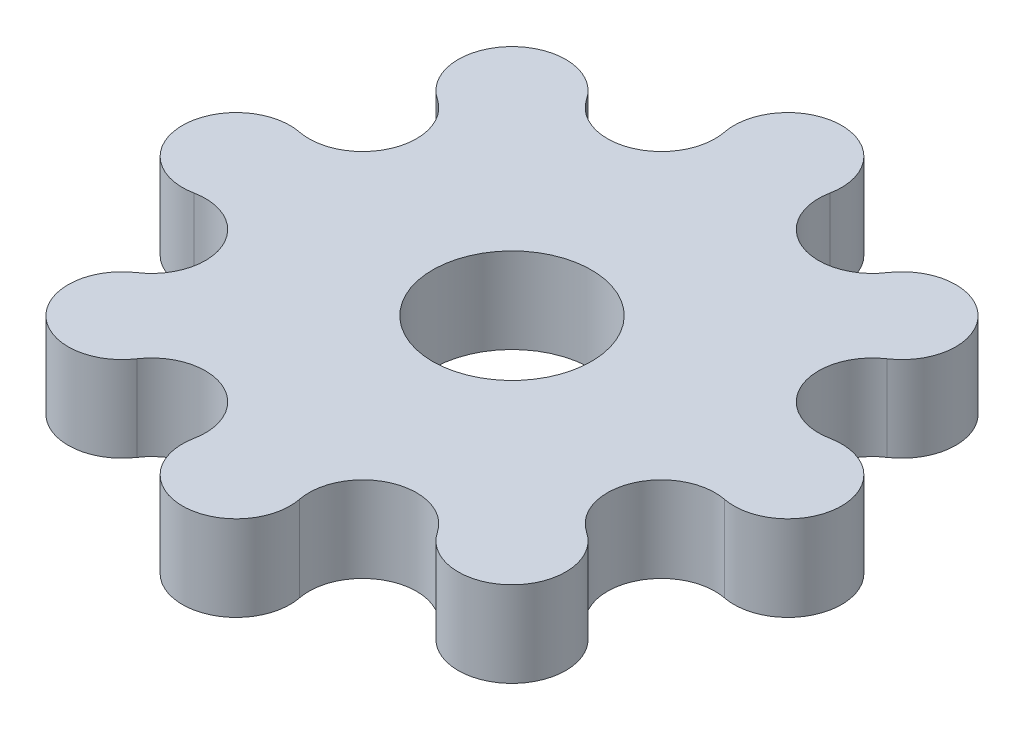
ISO-10303-21;
HEADER;
FILE_DESCRIPTION(('STEP AP214'),'2;1');
FILE_NAME('part.step','',(''),(''),'','','');
FILE_SCHEMA(('AUTOMOTIVE_DESIGN { 1 0 10303 214 1 1 1 1 }'));
ENDSEC;
DATA;
#1=APPLICATION_CONTEXT('core data for automotive mechanical design processes');
#2=APPLICATION_PROTOCOL_DEFINITION('international standard','automotive_design',2000,#1);
#3=PRODUCT_CONTEXT('',#1,'mechanical');
#4=PRODUCT('Part','Part','',(#3));
#5=PRODUCT_RELATED_PRODUCT_CATEGORY('part','',(#4));
#6=PRODUCT_DEFINITION_FORMATION('','',#4);
#7=PRODUCT_DEFINITION_CONTEXT('part definition',#1,'design');
#8=PRODUCT_DEFINITION('design','',#6,#7);
#9=PRODUCT_DEFINITION_SHAPE('','',#8);
#10=(LENGTH_UNIT() NAMED_UNIT(*) SI_UNIT(.MILLI.,.METRE.));
#11=(NAMED_UNIT(*) PLANE_ANGLE_UNIT() SI_UNIT($,.RADIAN.));
#12=(NAMED_UNIT(*) SI_UNIT($,.STERADIAN.) SOLID_ANGLE_UNIT());
#13=UNCERTAINTY_MEASURE_WITH_UNIT(LENGTH_MEASURE(1.E-05),#10,'distance_accuracy_value','');
#14=(GEOMETRIC_REPRESENTATION_CONTEXT(3) GLOBAL_UNCERTAINTY_ASSIGNED_CONTEXT((#13)) GLOBAL_UNIT_ASSIGNED_CONTEXT((#10,
#11,#12)) REPRESENTATION_CONTEXT('',''));
#15=CARTESIAN_POINT('',(0.,0.,0.));
#16=DIRECTION('',(0.,0.,1.));
#17=DIRECTION('',(1.,0.,0.));
#18=AXIS2_PLACEMENT_3D('',#15,#16,#17);
#19=CARTESIAN_POINT('',(-1.96157056080646,3.175,-9.86148114693376));
#20=DIRECTION('',(0.,1.,0.));
#21=DIRECTION('',(0.,0.,1.));
#22=AXIS2_PLACEMENT_3D('',#19,#20,#21);
#23=PLANE('',#22);
#24=CARTESIAN_POINT('',(-3.92314112161292,3.175,-9.47130050290151));
#25=DIRECTION('',(0.,-1.,0.));
#26=DIRECTION('',(0.,0.,1.));
#27=AXIS2_PLACEMENT_3D('',#24,#25,#26);
#28=CIRCLE('',#27,2.);
#29=CARTESIAN_POINT('',(-1.96157056080646,3.175,-9.86148114693376));
#30=VERTEX_POINT('',#29);
#31=CARTESIAN_POINT('',(-5.58608034621801,3.175,-8.3601600368623));
#32=VERTEX_POINT('',#31);
#33=EDGE_CURVE('E208',#30,#32,#28,.T.);
#34=ORIENTED_EDGE('',*,*,#33,.T.);
#35=CARTESIAN_POINT('',(-7.2490195708231,3.175,-7.2490195708231));
#36=DIRECTION('',(0.,1.,0.));
#37=DIRECTION('',(0.,0.,1.));
#38=AXIS2_PLACEMENT_3D('',#35,#36,#37);
#39=CIRCLE('',#38,2.);
#40=CARTESIAN_POINT('',(-8.36016003686231,3.175,-5.58608034621801));
#41=VERTEX_POINT('',#40);
#42=EDGE_CURVE('E116',#32,#41,#39,.T.);
#43=ORIENTED_EDGE('',*,*,#42,.T.);
#44=CARTESIAN_POINT('',(-9.47130050290151,3.175,-3.92314112161292));
#45=DIRECTION('',(0.,-1.,0.));
#46=DIRECTION('',(0.,0.,1.));
#47=AXIS2_PLACEMENT_3D('',#44,#45,#46);
#48=CIRCLE('',#47,2.);
#49=CARTESIAN_POINT('',(-9.86148114693376,3.175,-1.96157056080646));
#50=VERTEX_POINT('',#49);
#51=EDGE_CURVE('E247',#41,#50,#48,.T.);
#52=ORIENTED_EDGE('',*,*,#51,.T.);
#53=CARTESIAN_POINT('',(-10.251661790966,3.175,0.));
#54=DIRECTION('',(0.,1.,0.));
#55=DIRECTION('',(0.,0.,1.));
#56=AXIS2_PLACEMENT_3D('',#53,#54,#55);
#57=CIRCLE('',#56,2.);
#58=CARTESIAN_POINT('',(-9.86148114693376,3.175,1.96157056080646));
#59=VERTEX_POINT('',#58);
#60=EDGE_CURVE('E266',#50,#59,#57,.T.);
#61=ORIENTED_EDGE('',*,*,#60,.T.);
#62=CARTESIAN_POINT('',(-9.47130050290151,3.175,3.92314112161293));
#63=DIRECTION('',(0.,-1.,0.));
#64=DIRECTION('',(0.,0.,1.));
#65=AXIS2_PLACEMENT_3D('',#62,#63,#64);
#66=CIRCLE('',#65,2.);
#67=CARTESIAN_POINT('',(-8.3601600368623,3.175,5.58608034621801));
#68=VERTEX_POINT('',#67);
#69=EDGE_CURVE('E263',#59,#68,#66,.T.);
#70=ORIENTED_EDGE('',*,*,#69,.T.);
#71=CARTESIAN_POINT('',(-7.2490195708231,3.175,7.2490195708231));
#72=DIRECTION('',(0.,1.,0.));
#73=DIRECTION('',(0.,0.,1.));
#74=AXIS2_PLACEMENT_3D('',#71,#72,#73);
#75=CIRCLE('',#74,2.);
#76=CARTESIAN_POINT('',(-5.58608034621801,3.175,8.3601600368623));
#77=VERTEX_POINT('',#76);
#78=EDGE_CURVE('E265',#68,#77,#75,.T.);
#79=ORIENTED_EDGE('',*,*,#78,.T.);
#80=CARTESIAN_POINT('',(-3.92314112161292,3.175,9.47130050290151));
#81=DIRECTION('',(0.,-1.,0.));
#82=DIRECTION('',(0.,0.,1.));
#83=AXIS2_PLACEMENT_3D('',#80,#81,#82);
#84=CIRCLE('',#83,2.);
#85=CARTESIAN_POINT('',(-1.96157056080646,3.175,9.86148114693376));
#86=VERTEX_POINT('',#85);
#87=EDGE_CURVE('E268',#77,#86,#84,.T.);
#88=ORIENTED_EDGE('',*,*,#87,.T.);
#89=CARTESIAN_POINT('',(0.,3.175,10.251661790966));
#90=DIRECTION('',(0.,1.,0.));
#91=DIRECTION('',(0.,0.,1.));
#92=AXIS2_PLACEMENT_3D('',#89,#90,#91);
#93=CIRCLE('',#92,2.);
#94=CARTESIAN_POINT('',(1.96157056080646,3.175,9.86148114693377));
#95=VERTEX_POINT('',#94);
#96=EDGE_CURVE('E274',#86,#95,#93,.T.);
#97=ORIENTED_EDGE('',*,*,#96,.T.);
#98=CARTESIAN_POINT('',(3.92314112161292,3.175,9.47130050290151));
#99=DIRECTION('',(0.,-1.,0.));
#100=DIRECTION('',(0.,0.,1.));
#101=AXIS2_PLACEMENT_3D('',#98,#99,#100);
#102=CIRCLE('',#101,2.);
#103=CARTESIAN_POINT('',(5.58608034621801,3.175,8.3601600368623));
#104=VERTEX_POINT('',#103);
#105=EDGE_CURVE('E276',#95,#104,#102,.T.);
#106=ORIENTED_EDGE('',*,*,#105,.T.);
#107=CARTESIAN_POINT('',(7.2490195708231,3.175,7.2490195708231));
#108=DIRECTION('',(0.,1.,0.));
#109=DIRECTION('',(0.,0.,1.));
#110=AXIS2_PLACEMENT_3D('',#107,#108,#109);
#111=CIRCLE('',#110,2.);
#112=CARTESIAN_POINT('',(8.3601600368623,3.175,5.58608034621801));
#113=VERTEX_POINT('',#112);
#114=EDGE_CURVE('E278',#104,#113,#111,.T.);
#115=ORIENTED_EDGE('',*,*,#114,.T.);
#116=CARTESIAN_POINT('',(9.47130050290151,3.175,3.92314112161292));
#117=DIRECTION('',(0.,-1.,0.));
#118=DIRECTION('',(0.,0.,1.));
#119=AXIS2_PLACEMENT_3D('',#116,#117,#118);
#120=CIRCLE('',#119,2.);
#121=CARTESIAN_POINT('',(9.86148114693376,3.175,1.96157056080646));
#122=VERTEX_POINT('',#121);
#123=EDGE_CURVE('E280',#113,#122,#120,.T.);
#124=ORIENTED_EDGE('',*,*,#123,.T.);
#125=CARTESIAN_POINT('',(10.251661790966,3.175,0.));
#126=DIRECTION('',(0.,1.,0.));
#127=DIRECTION('',(0.,0.,1.));
#128=AXIS2_PLACEMENT_3D('',#125,#126,#127);
#129=CIRCLE('',#128,2.);
#130=CARTESIAN_POINT('',(9.86148114693376,3.175,-1.96157056080646));
#131=VERTEX_POINT('',#130);
#132=EDGE_CURVE('E282',#122,#131,#129,.T.);
#133=ORIENTED_EDGE('',*,*,#132,.T.);
#134=CARTESIAN_POINT('',(9.47130050290151,3.175,-3.92314112161292));
#135=DIRECTION('',(0.,-1.,0.));
#136=DIRECTION('',(0.,0.,1.));
#137=AXIS2_PLACEMENT_3D('',#134,#135,#136);
#138=CIRCLE('',#137,2.);
#139=CARTESIAN_POINT('',(8.36016003686231,3.175,-5.58608034621801));
#140=VERTEX_POINT('',#139);
#141=EDGE_CURVE('E159',#131,#140,#138,.T.);
#142=ORIENTED_EDGE('',*,*,#141,.T.);
#143=CARTESIAN_POINT('',(7.2490195708231,3.175,-7.2490195708231));
#144=DIRECTION('',(0.,1.,0.));
#145=DIRECTION('',(0.,0.,1.));
#146=AXIS2_PLACEMENT_3D('',#143,#144,#145);
#147=CIRCLE('',#146,2.);
#148=CARTESIAN_POINT('',(5.58608034621801,3.175,-8.3601600368623));
#149=VERTEX_POINT('',#148);
#150=EDGE_CURVE('E153',#140,#149,#147,.T.);
#151=ORIENTED_EDGE('',*,*,#150,.T.);
#152=CARTESIAN_POINT('',(3.92314112161292,3.175,-9.47130050290151));
#153=DIRECTION('',(0.,-1.,0.));
#154=DIRECTION('',(0.,0.,1.));
#155=AXIS2_PLACEMENT_3D('',#152,#153,#154);
#156=CIRCLE('',#155,2.);
#157=CARTESIAN_POINT('',(1.96157056080646,3.175,-9.86148114693376));
#158=VERTEX_POINT('',#157);
#159=EDGE_CURVE('E157',#149,#158,#156,.T.);
#160=ORIENTED_EDGE('',*,*,#159,.T.);
#161=CARTESIAN_POINT('',(0.,3.175,-10.251661790966));
#162=DIRECTION('',(0.,1.,0.));
#163=DIRECTION('',(0.,0.,1.));
#164=AXIS2_PLACEMENT_3D('',#161,#162,#163);
#165=CIRCLE('',#164,2.);
#166=EDGE_CURVE('E49',#158,#30,#165,.T.);
#167=ORIENTED_EDGE('',*,*,#166,.T.);
#168=EDGE_LOOP('',(#34,#43,#52,#61,#70,#79,#88,#97,#106,#115,#124,#133,#142,#151,#160,#167));
#169=FACE_BOUND('',#168,.T.);
#170=CARTESIAN_POINT('',(0.,3.175,0.));
#171=DIRECTION('',(0.,1.,0.));
#172=DIRECTION('',(0.,0.,1.));
#173=AXIS2_PLACEMENT_3D('',#170,#171,#172);
#174=CIRCLE('',#173,2.95);
#175=CARTESIAN_POINT('',(0.,3.175,2.95));
#176=VERTEX_POINT('',#175);
#177=EDGE_CURVE('E487',#176,#176,#174,.T.);
#178=ORIENTED_EDGE('',*,*,#177,.F.);
#179=EDGE_LOOP('',(#178));
#180=FACE_BOUND('',#179,.T.);
#181=ADVANCED_FACE('F32',(#169,#180),#23,.T.);
#182=CARTESIAN_POINT('',(-1.96157056080646,0.,-9.86148114693376));
#183=DIRECTION('',(0.,1.,0.));
#184=DIRECTION('',(0.,0.,1.));
#185=AXIS2_PLACEMENT_3D('',#182,#183,#184);
#186=PLANE('',#185);
#187=CARTESIAN_POINT('',(-3.92314112161292,0.,-9.47130050290151));
#188=DIRECTION('',(0.,-1.,0.));
#189=DIRECTION('',(0.,0.,1.));
#190=AXIS2_PLACEMENT_3D('',#187,#188,#189);
#191=CIRCLE('',#190,2.);
#192=CARTESIAN_POINT('',(-1.96157056080646,0.,-9.86148114693376));
#193=VERTEX_POINT('',#192);
#194=CARTESIAN_POINT('',(-5.58608034621801,0.,-8.3601600368623));
#195=VERTEX_POINT('',#194);
#196=EDGE_CURVE('E177',#193,#195,#191,.T.);
#197=ORIENTED_EDGE('',*,*,#196,.F.);
#198=CARTESIAN_POINT('',(0.,0.,-10.251661790966));
#199=DIRECTION('',(0.,1.,0.));
#200=DIRECTION('',(0.,0.,1.));
#201=AXIS2_PLACEMENT_3D('',#198,#199,#200);
#202=CIRCLE('',#201,2.);
#203=CARTESIAN_POINT('',(1.96157056080646,0.,-9.86148114693376));
#204=VERTEX_POINT('',#203);
#205=EDGE_CURVE('E108',#204,#193,#202,.T.);
#206=ORIENTED_EDGE('',*,*,#205,.F.);
#207=CARTESIAN_POINT('',(3.92314112161292,0.,-9.47130050290151));
#208=DIRECTION('',(0.,-1.,0.));
#209=DIRECTION('',(0.,0.,1.));
#210=AXIS2_PLACEMENT_3D('',#207,#208,#209);
#211=CIRCLE('',#210,2.);
#212=CARTESIAN_POINT('',(5.58608034621801,0.,-8.3601600368623));
#213=VERTEX_POINT('',#212);
#214=EDGE_CURVE('E102',#213,#204,#211,.T.);
#215=ORIENTED_EDGE('',*,*,#214,.F.);
#216=CARTESIAN_POINT('',(7.2490195708231,0.,-7.2490195708231));
#217=DIRECTION('',(0.,1.,0.));
#218=DIRECTION('',(0.,0.,1.));
#219=AXIS2_PLACEMENT_3D('',#216,#217,#218);
#220=CIRCLE('',#219,2.);
#221=CARTESIAN_POINT('',(8.36016003686231,0.,-5.58608034621801));
#222=VERTEX_POINT('',#221);
#223=EDGE_CURVE('E167',#222,#213,#220,.T.);
#224=ORIENTED_EDGE('',*,*,#223,.F.);
#225=CARTESIAN_POINT('',(9.47130050290151,0.,-3.92314112161292));
#226=DIRECTION('',(0.,-1.,0.));
#227=DIRECTION('',(0.,0.,1.));
#228=AXIS2_PLACEMENT_3D('',#225,#226,#227);
#229=CIRCLE('',#228,2.);
#230=CARTESIAN_POINT('',(9.86148114693376,0.,-1.96157056080646));
#231=VERTEX_POINT('',#230);
#232=EDGE_CURVE('E203',#231,#222,#229,.T.);
#233=ORIENTED_EDGE('',*,*,#232,.F.);
#234=CARTESIAN_POINT('',(10.251661790966,0.,0.));
#235=DIRECTION('',(0.,1.,0.));
#236=DIRECTION('',(0.,0.,1.));
#237=AXIS2_PLACEMENT_3D('',#234,#235,#236);
#238=CIRCLE('',#237,2.);
#239=CARTESIAN_POINT('',(9.86148114693376,0.,1.96157056080646));
#240=VERTEX_POINT('',#239);
#241=EDGE_CURVE('E201',#240,#231,#238,.T.);
#242=ORIENTED_EDGE('',*,*,#241,.F.);
#243=CARTESIAN_POINT('',(9.47130050290151,0.,3.92314112161292));
#244=DIRECTION('',(0.,-1.,0.));
#245=DIRECTION('',(0.,0.,1.));
#246=AXIS2_PLACEMENT_3D('',#243,#244,#245);
#247=CIRCLE('',#246,2.);
#248=CARTESIAN_POINT('',(8.3601600368623,0.,5.58608034621801));
#249=VERTEX_POINT('',#248);
#250=EDGE_CURVE('E199',#249,#240,#247,.T.);
#251=ORIENTED_EDGE('',*,*,#250,.F.);
#252=CARTESIAN_POINT('',(7.2490195708231,0.,7.2490195708231));
#253=DIRECTION('',(0.,1.,0.));
#254=DIRECTION('',(0.,0.,1.));
#255=AXIS2_PLACEMENT_3D('',#252,#253,#254);
#256=CIRCLE('',#255,2.);
#257=CARTESIAN_POINT('',(5.58608034621801,0.,8.3601600368623));
#258=VERTEX_POINT('',#257);
#259=EDGE_CURVE('E197',#258,#249,#256,.T.);
#260=ORIENTED_EDGE('',*,*,#259,.F.);
#261=CARTESIAN_POINT('',(3.92314112161292,0.,9.47130050290151));
#262=DIRECTION('',(0.,-1.,0.));
#263=DIRECTION('',(0.,0.,1.));
#264=AXIS2_PLACEMENT_3D('',#261,#262,#263);
#265=CIRCLE('',#264,2.);
#266=CARTESIAN_POINT('',(1.96157056080646,0.,9.86148114693377));
#267=VERTEX_POINT('',#266);
#268=EDGE_CURVE('E195',#267,#258,#265,.T.);
#269=ORIENTED_EDGE('',*,*,#268,.F.);
#270=CARTESIAN_POINT('',(0.,0.,10.251661790966));
#271=DIRECTION('',(0.,1.,0.));
#272=DIRECTION('',(0.,0.,1.));
#273=AXIS2_PLACEMENT_3D('',#270,#271,#272);
#274=CIRCLE('',#273,2.);
#275=CARTESIAN_POINT('',(-1.96157056080646,0.,9.86148114693376));
#276=VERTEX_POINT('',#275);
#277=EDGE_CURVE('E193',#276,#267,#274,.T.);
#278=ORIENTED_EDGE('',*,*,#277,.F.);
#279=CARTESIAN_POINT('',(-3.92314112161292,0.,9.47130050290151));
#280=DIRECTION('',(0.,-1.,0.));
#281=DIRECTION('',(0.,0.,1.));
#282=AXIS2_PLACEMENT_3D('',#279,#280,#281);
#283=CIRCLE('',#282,2.);
#284=CARTESIAN_POINT('',(-5.58608034621801,0.,8.3601600368623));
#285=VERTEX_POINT('',#284);
#286=EDGE_CURVE('E191',#285,#276,#283,.T.);
#287=ORIENTED_EDGE('',*,*,#286,.F.);
#288=CARTESIAN_POINT('',(-7.2490195708231,0.,7.2490195708231));
#289=DIRECTION('',(0.,1.,0.));
#290=DIRECTION('',(0.,0.,1.));
#291=AXIS2_PLACEMENT_3D('',#288,#289,#290);
#292=CIRCLE('',#291,2.);
#293=CARTESIAN_POINT('',(-8.3601600368623,0.,5.58608034621801));
#294=VERTEX_POINT('',#293);
#295=EDGE_CURVE('E189',#294,#285,#292,.T.);
#296=ORIENTED_EDGE('',*,*,#295,.F.);
#297=CARTESIAN_POINT('',(-9.47130050290151,0.,3.92314112161293));
#298=DIRECTION('',(0.,-1.,0.));
#299=DIRECTION('',(0.,0.,1.));
#300=AXIS2_PLACEMENT_3D('',#297,#298,#299);
#301=CIRCLE('',#300,2.);
#302=CARTESIAN_POINT('',(-9.86148114693376,0.,1.96157056080646));
#303=VERTEX_POINT('',#302);
#304=EDGE_CURVE('E187',#303,#294,#301,.T.);
#305=ORIENTED_EDGE('',*,*,#304,.F.);
#306=CARTESIAN_POINT('',(-10.251661790966,0.,0.));
#307=DIRECTION('',(0.,1.,0.));
#308=DIRECTION('',(0.,0.,1.));
#309=AXIS2_PLACEMENT_3D('',#306,#307,#308);
#310=CIRCLE('',#309,2.);
#311=CARTESIAN_POINT('',(-9.86148114693376,0.,-1.96157056080646));
#312=VERTEX_POINT('',#311);
#313=EDGE_CURVE('E185',#312,#303,#310,.T.);
#314=ORIENTED_EDGE('',*,*,#313,.F.);
#315=CARTESIAN_POINT('',(-9.47130050290151,0.,-3.92314112161292));
#316=DIRECTION('',(0.,-1.,0.));
#317=DIRECTION('',(0.,0.,1.));
#318=AXIS2_PLACEMENT_3D('',#315,#316,#317);
#319=CIRCLE('',#318,2.);
#320=CARTESIAN_POINT('',(-8.36016003686231,0.,-5.58608034621801));
#321=VERTEX_POINT('',#320);
#322=EDGE_CURVE('E183',#321,#312,#319,.T.);
#323=ORIENTED_EDGE('',*,*,#322,.F.);
#324=CARTESIAN_POINT('',(-7.2490195708231,0.,-7.2490195708231));
#325=DIRECTION('',(0.,1.,0.));
#326=DIRECTION('',(0.,0.,1.));
#327=AXIS2_PLACEMENT_3D('',#324,#325,#326);
#328=CIRCLE('',#327,2.);
#329=EDGE_CURVE('E180',#195,#321,#328,.T.);
#330=ORIENTED_EDGE('',*,*,#329,.F.);
#331=EDGE_LOOP('',(#197,#206,#215,#224,#233,#242,#251,#260,#269,#278,#287,#296,#305,#314,#323,#330));
#332=FACE_BOUND('',#331,.T.);
#333=CARTESIAN_POINT('',(0.,0.,0.));
#334=DIRECTION('',(0.,1.,0.));
#335=DIRECTION('',(0.,0.,1.));
#336=AXIS2_PLACEMENT_3D('',#333,#334,#335);
#337=CIRCLE('',#336,2.95);
#338=CARTESIAN_POINT('',(0.,0.,2.95));
#339=VERTEX_POINT('',#338);
#340=EDGE_CURVE('E181',#339,#339,#337,.F.);
#341=ORIENTED_EDGE('',*,*,#340,.F.);
#342=EDGE_LOOP('',(#341));
#343=FACE_BOUND('',#342,.T.);
#344=ADVANCED_FACE('F251',(#332,#343),#186,.F.);
#345=CARTESIAN_POINT('',(-3.92314112161292,3.175,-9.47130050290151));
#346=DIRECTION('',(0.,-1.,0.));
#347=DIRECTION('',(0.,0.,-1.));
#348=AXIS2_PLACEMENT_3D('',#345,#346,#347);
#349=CYLINDRICAL_SURFACE('',#348,2.);
#350=ORIENTED_EDGE('',*,*,#196,.T.);
#351=DIRECTION('',(0.,-1.,0.));
#352=VECTOR('',#351,1.);
#353=CARTESIAN_POINT('',(-5.58608034621801,3.175,-8.3601600368623));
#354=LINE('',#353,#352);
#355=EDGE_CURVE('E11',#32,#195,#354,.T.);
#356=ORIENTED_EDGE('',*,*,#355,.F.);
#357=ORIENTED_EDGE('',*,*,#33,.F.);
#358=DIRECTION('',(0.,-1.,0.));
#359=VECTOR('',#358,1.);
#360=CARTESIAN_POINT('',(-1.96157056080646,3.175,-9.86148114693376));
#361=LINE('',#360,#359);
#362=EDGE_CURVE('E173',#30,#193,#361,.T.);
#363=ORIENTED_EDGE('',*,*,#362,.T.);
#364=EDGE_LOOP('',(#350,#356,#357,#363));
#365=FACE_BOUND('',#364,.T.);
#366=ADVANCED_FACE('F34',(#365),#349,.F.);
#367=CARTESIAN_POINT('',(-7.2490195708231,3.175,-7.2490195708231));
#368=DIRECTION('',(0.,-1.,0.));
#369=DIRECTION('',(0.,0.,-1.));
#370=AXIS2_PLACEMENT_3D('',#367,#368,#369);
#371=CYLINDRICAL_SURFACE('',#370,2.);
#372=ORIENTED_EDGE('',*,*,#329,.T.);
#373=DIRECTION('',(0.,-1.,0.));
#374=VECTOR('',#373,1.);
#375=CARTESIAN_POINT('',(-8.36016003686231,3.175,-5.58608034621801));
#376=LINE('',#375,#374);
#377=EDGE_CURVE('E41',#41,#321,#376,.T.);
#378=ORIENTED_EDGE('',*,*,#377,.F.);
#379=ORIENTED_EDGE('',*,*,#42,.F.);
#380=ORIENTED_EDGE('',*,*,#355,.T.);
#381=EDGE_LOOP('',(#372,#378,#379,#380));
#382=FACE_BOUND('',#381,.T.);
#383=ADVANCED_FACE('F316',(#382),#371,.T.);
#384=CARTESIAN_POINT('',(-9.47130050290151,3.175,-3.92314112161292));
#385=DIRECTION('',(0.,-1.,0.));
#386=DIRECTION('',(0.,0.,-1.));
#387=AXIS2_PLACEMENT_3D('',#384,#385,#386);
#388=CYLINDRICAL_SURFACE('',#387,2.);
#389=ORIENTED_EDGE('',*,*,#322,.T.);
#390=DIRECTION('',(0.,-1.,0.));
#391=VECTOR('',#390,1.);
#392=CARTESIAN_POINT('',(-9.86148114693376,3.175,-1.96157056080646));
#393=LINE('',#392,#391);
#394=EDGE_CURVE('E239',#50,#312,#393,.T.);
#395=ORIENTED_EDGE('',*,*,#394,.F.);
#396=ORIENTED_EDGE('',*,*,#51,.F.);
#397=ORIENTED_EDGE('',*,*,#377,.T.);
#398=EDGE_LOOP('',(#389,#395,#396,#397));
#399=FACE_BOUND('',#398,.T.);
#400=ADVANCED_FACE('F245',(#399),#388,.F.);
#401=CARTESIAN_POINT('',(-10.251661790966,3.175,0.));
#402=DIRECTION('',(0.,-1.,0.));
#403=DIRECTION('',(0.,0.,-1.));
#404=AXIS2_PLACEMENT_3D('',#401,#402,#403);
#405=CYLINDRICAL_SURFACE('',#404,2.);
#406=ORIENTED_EDGE('',*,*,#313,.T.);
#407=DIRECTION('',(0.,-1.,0.));
#408=VECTOR('',#407,1.);
#409=CARTESIAN_POINT('',(-9.86148114693376,3.175,1.96157056080646));
#410=LINE('',#409,#408);
#411=EDGE_CURVE('E236',#59,#303,#410,.T.);
#412=ORIENTED_EDGE('',*,*,#411,.F.);
#413=ORIENTED_EDGE('',*,*,#60,.F.);
#414=ORIENTED_EDGE('',*,*,#394,.T.);
#415=EDGE_LOOP('',(#406,#412,#413,#414));
#416=FACE_BOUND('',#415,.T.);
#417=ADVANCED_FACE('F257',(#416),#405,.T.);
#418=CARTESIAN_POINT('',(-9.47130050290151,3.175,3.92314112161293));
#419=DIRECTION('',(0.,-1.,0.));
#420=DIRECTION('',(0.,0.,-1.));
#421=AXIS2_PLACEMENT_3D('',#418,#419,#420);
#422=CYLINDRICAL_SURFACE('',#421,2.);
#423=ORIENTED_EDGE('',*,*,#304,.T.);
#424=DIRECTION('',(0.,-1.,0.));
#425=VECTOR('',#424,1.);
#426=CARTESIAN_POINT('',(-8.3601600368623,3.175,5.58608034621801));
#427=LINE('',#426,#425);
#428=EDGE_CURVE('E233',#68,#294,#427,.T.);
#429=ORIENTED_EDGE('',*,*,#428,.F.);
#430=ORIENTED_EDGE('',*,*,#69,.F.);
#431=ORIENTED_EDGE('',*,*,#411,.T.);
#432=EDGE_LOOP('',(#423,#429,#430,#431));
#433=FACE_BOUND('',#432,.T.);
#434=ADVANCED_FACE('F261',(#433),#422,.F.);
#435=CARTESIAN_POINT('',(-7.2490195708231,3.175,7.2490195708231));
#436=DIRECTION('',(0.,-1.,0.));
#437=DIRECTION('',(0.,0.,-1.));
#438=AXIS2_PLACEMENT_3D('',#435,#436,#437);
#439=CYLINDRICAL_SURFACE('',#438,2.);
#440=ORIENTED_EDGE('',*,*,#295,.T.);
#441=DIRECTION('',(0.,-1.,0.));
#442=VECTOR('',#441,1.);
#443=CARTESIAN_POINT('',(-5.58608034621801,3.175,8.3601600368623));
#444=LINE('',#443,#442);
#445=EDGE_CURVE('E230',#77,#285,#444,.T.);
#446=ORIENTED_EDGE('',*,*,#445,.F.);
#447=ORIENTED_EDGE('',*,*,#78,.F.);
#448=ORIENTED_EDGE('',*,*,#428,.T.);
#449=EDGE_LOOP('',(#440,#446,#447,#448));
#450=FACE_BOUND('',#449,.T.);
#451=ADVANCED_FACE('F329',(#450),#439,.T.);
#452=CARTESIAN_POINT('',(-3.92314112161292,3.175,9.47130050290151));
#453=DIRECTION('',(0.,-1.,0.));
#454=DIRECTION('',(0.,0.,-1.));
#455=AXIS2_PLACEMENT_3D('',#452,#453,#454);
#456=CYLINDRICAL_SURFACE('',#455,2.);
#457=ORIENTED_EDGE('',*,*,#286,.T.);
#458=DIRECTION('',(0.,-1.,0.));
#459=VECTOR('',#458,1.);
#460=CARTESIAN_POINT('',(-1.96157056080646,3.175,9.86148114693376));
#461=LINE('',#460,#459);
#462=EDGE_CURVE('E227',#86,#276,#461,.T.);
#463=ORIENTED_EDGE('',*,*,#462,.F.);
#464=ORIENTED_EDGE('',*,*,#87,.F.);
#465=ORIENTED_EDGE('',*,*,#445,.T.);
#466=EDGE_LOOP('',(#457,#463,#464,#465));
#467=FACE_BOUND('',#466,.T.);
#468=ADVANCED_FACE('F332',(#467),#456,.F.);
#469=CARTESIAN_POINT('',(0.,3.175,10.251661790966));
#470=DIRECTION('',(0.,-1.,0.));
#471=DIRECTION('',(0.,0.,-1.));
#472=AXIS2_PLACEMENT_3D('',#469,#470,#471);
#473=CYLINDRICAL_SURFACE('',#472,2.);
#474=ORIENTED_EDGE('',*,*,#277,.T.);
#475=DIRECTION('',(0.,-1.,0.));
#476=VECTOR('',#475,1.);
#477=CARTESIAN_POINT('',(1.96157056080646,3.175,9.86148114693377));
#478=LINE('',#477,#476);
#479=EDGE_CURVE('E224',#95,#267,#478,.T.);
#480=ORIENTED_EDGE('',*,*,#479,.F.);
#481=ORIENTED_EDGE('',*,*,#96,.F.);
#482=ORIENTED_EDGE('',*,*,#462,.T.);
#483=EDGE_LOOP('',(#474,#480,#481,#482));
#484=FACE_BOUND('',#483,.T.);
#485=ADVANCED_FACE('F336',(#484),#473,.T.);
#486=CARTESIAN_POINT('',(3.92314112161292,3.175,9.47130050290151));
#487=DIRECTION('',(0.,-1.,0.));
#488=DIRECTION('',(0.,0.,-1.));
#489=AXIS2_PLACEMENT_3D('',#486,#487,#488);
#490=CYLINDRICAL_SURFACE('',#489,2.);
#491=ORIENTED_EDGE('',*,*,#268,.T.);
#492=DIRECTION('',(0.,-1.,0.));
#493=VECTOR('',#492,1.);
#494=CARTESIAN_POINT('',(5.58608034621801,3.175,8.3601600368623));
#495=LINE('',#494,#493);
#496=EDGE_CURVE('E221',#104,#258,#495,.T.);
#497=ORIENTED_EDGE('',*,*,#496,.F.);
#498=ORIENTED_EDGE('',*,*,#105,.F.);
#499=ORIENTED_EDGE('',*,*,#479,.T.);
#500=EDGE_LOOP('',(#491,#497,#498,#499));
#501=FACE_BOUND('',#500,.T.);
#502=ADVANCED_FACE('F340',(#501),#490,.F.);
#503=CARTESIAN_POINT('',(7.2490195708231,3.175,7.2490195708231));
#504=DIRECTION('',(0.,-1.,0.));
#505=DIRECTION('',(0.,0.,-1.));
#506=AXIS2_PLACEMENT_3D('',#503,#504,#505);
#507=CYLINDRICAL_SURFACE('',#506,2.);
#508=ORIENTED_EDGE('',*,*,#259,.T.);
#509=DIRECTION('',(0.,-1.,0.));
#510=VECTOR('',#509,1.);
#511=CARTESIAN_POINT('',(8.3601600368623,3.175,5.58608034621801));
#512=LINE('',#511,#510);
#513=EDGE_CURVE('E218',#113,#249,#512,.T.);
#514=ORIENTED_EDGE('',*,*,#513,.F.);
#515=ORIENTED_EDGE('',*,*,#114,.F.);
#516=ORIENTED_EDGE('',*,*,#496,.T.);
#517=EDGE_LOOP('',(#508,#514,#515,#516));
#518=FACE_BOUND('',#517,.T.);
#519=ADVANCED_FACE('F344',(#518),#507,.T.);
#520=CARTESIAN_POINT('',(9.47130050290151,3.175,3.92314112161292));
#521=DIRECTION('',(0.,-1.,0.));
#522=DIRECTION('',(0.,0.,-1.));
#523=AXIS2_PLACEMENT_3D('',#520,#521,#522);
#524=CYLINDRICAL_SURFACE('',#523,2.);
#525=ORIENTED_EDGE('',*,*,#250,.T.);
#526=DIRECTION('',(0.,-1.,0.));
#527=VECTOR('',#526,1.);
#528=CARTESIAN_POINT('',(9.86148114693376,3.175,1.96157056080646));
#529=LINE('',#528,#527);
#530=EDGE_CURVE('E215',#122,#240,#529,.T.);
#531=ORIENTED_EDGE('',*,*,#530,.F.);
#532=ORIENTED_EDGE('',*,*,#123,.F.);
#533=ORIENTED_EDGE('',*,*,#513,.T.);
#534=EDGE_LOOP('',(#525,#531,#532,#533));
#535=FACE_BOUND('',#534,.T.);
#536=ADVANCED_FACE('F348',(#535),#524,.F.);
#537=CARTESIAN_POINT('',(10.251661790966,3.175,0.));
#538=DIRECTION('',(0.,-1.,0.));
#539=DIRECTION('',(0.,0.,-1.));
#540=AXIS2_PLACEMENT_3D('',#537,#538,#539);
#541=CYLINDRICAL_SURFACE('',#540,2.);
#542=ORIENTED_EDGE('',*,*,#241,.T.);
#543=DIRECTION('',(0.,-1.,0.));
#544=VECTOR('',#543,1.);
#545=CARTESIAN_POINT('',(9.86148114693376,3.175,-1.96157056080646));
#546=LINE('',#545,#544);
#547=EDGE_CURVE('E212',#131,#231,#546,.T.);
#548=ORIENTED_EDGE('',*,*,#547,.F.);
#549=ORIENTED_EDGE('',*,*,#132,.F.);
#550=ORIENTED_EDGE('',*,*,#530,.T.);
#551=EDGE_LOOP('',(#542,#548,#549,#550));
#552=FACE_BOUND('',#551,.T.);
#553=ADVANCED_FACE('F288',(#552),#541,.T.);
#554=CARTESIAN_POINT('',(9.47130050290151,3.175,-3.92314112161292));
#555=DIRECTION('',(0.,-1.,0.));
#556=DIRECTION('',(0.,0.,-1.));
#557=AXIS2_PLACEMENT_3D('',#554,#555,#556);
#558=CYLINDRICAL_SURFACE('',#557,2.);
#559=ORIENTED_EDGE('',*,*,#232,.T.);
#560=DIRECTION('',(0.,-1.,0.));
#561=VECTOR('',#560,1.);
#562=CARTESIAN_POINT('',(8.36016003686231,3.175,-5.58608034621801));
#563=LINE('',#562,#561);
#564=EDGE_CURVE('E168',#140,#222,#563,.T.);
#565=ORIENTED_EDGE('',*,*,#564,.F.);
#566=ORIENTED_EDGE('',*,*,#141,.F.);
#567=ORIENTED_EDGE('',*,*,#547,.T.);
#568=EDGE_LOOP('',(#559,#565,#566,#567));
#569=FACE_BOUND('',#568,.T.);
#570=ADVANCED_FACE('F292',(#569),#558,.F.);
#571=CARTESIAN_POINT('',(7.2490195708231,3.175,-7.2490195708231));
#572=DIRECTION('',(0.,-1.,0.));
#573=DIRECTION('',(0.,0.,-1.));
#574=AXIS2_PLACEMENT_3D('',#571,#572,#573);
#575=CYLINDRICAL_SURFACE('',#574,2.);
#576=ORIENTED_EDGE('',*,*,#223,.T.);
#577=DIRECTION('',(0.,-1.,0.));
#578=VECTOR('',#577,1.);
#579=CARTESIAN_POINT('',(5.58608034621801,3.175,-8.3601600368623));
#580=LINE('',#579,#578);
#581=EDGE_CURVE('E164',#149,#213,#580,.T.);
#582=ORIENTED_EDGE('',*,*,#581,.F.);
#583=ORIENTED_EDGE('',*,*,#150,.F.);
#584=ORIENTED_EDGE('',*,*,#564,.T.);
#585=EDGE_LOOP('',(#576,#582,#583,#584));
#586=FACE_BOUND('',#585,.T.);
#587=ADVANCED_FACE('F165',(#586),#575,.T.);
#588=CARTESIAN_POINT('',(3.92314112161292,3.175,-9.47130050290151));
#589=DIRECTION('',(0.,-1.,0.));
#590=DIRECTION('',(0.,0.,-1.));
#591=AXIS2_PLACEMENT_3D('',#588,#589,#590);
#592=CYLINDRICAL_SURFACE('',#591,2.);
#593=ORIENTED_EDGE('',*,*,#214,.T.);
#594=DIRECTION('',(0.,-1.,0.));
#595=VECTOR('',#594,1.);
#596=CARTESIAN_POINT('',(1.96157056080646,3.175,-9.86148114693376));
#597=LINE('',#596,#595);
#598=EDGE_CURVE('E169',#158,#204,#597,.T.);
#599=ORIENTED_EDGE('',*,*,#598,.F.);
#600=ORIENTED_EDGE('',*,*,#159,.F.);
#601=ORIENTED_EDGE('',*,*,#581,.T.);
#602=EDGE_LOOP('',(#593,#599,#600,#601));
#603=FACE_BOUND('',#602,.T.);
#604=ADVANCED_FACE('F171',(#603),#592,.F.);
#605=CARTESIAN_POINT('',(0.,3.175,-10.251661790966));
#606=DIRECTION('',(0.,-1.,0.));
#607=DIRECTION('',(0.,0.,-1.));
#608=AXIS2_PLACEMENT_3D('',#605,#606,#607);
#609=CYLINDRICAL_SURFACE('',#608,2.);
#610=ORIENTED_EDGE('',*,*,#205,.T.);
#611=ORIENTED_EDGE('',*,*,#362,.F.);
#612=ORIENTED_EDGE('',*,*,#166,.F.);
#613=ORIENTED_EDGE('',*,*,#598,.T.);
#614=EDGE_LOOP('',(#610,#611,#612,#613));
#615=FACE_BOUND('',#614,.T.);
#616=ADVANCED_FACE('F296',(#615),#609,.T.);
#617=CARTESIAN_POINT('',(0.,-11.3137084989848,0.));
#618=DIRECTION('',(0.,1.,0.));
#619=DIRECTION('',(0.,0.,1.));
#620=AXIS2_PLACEMENT_3D('',#617,#618,#619);
#621=CYLINDRICAL_SURFACE('',#620,2.95);
#622=ORIENTED_EDGE('',*,*,#340,.T.);
#623=EDGE_LOOP('',(#622));
#624=FACE_BOUND('',#623,.T.);
#625=ORIENTED_EDGE('',*,*,#177,.T.);
#626=EDGE_LOOP('',(#625));
#627=FACE_BOUND('',#626,.T.);
#628=ADVANCED_FACE('F298',(#624,#627),#621,.F.);
#629=CLOSED_SHELL('',(#181,#344,#366,#383,#400,#417,#434,#451,#468,#485,#502,#519,#536,#553,
#570,#587,#604,#616,#628));
#630=MANIFOLD_SOLID_BREP('B2',#629);
#631=ADVANCED_BREP_SHAPE_REPRESENTATION('',(#18,#630),#14);
#632=SHAPE_DEFINITION_REPRESENTATION(#9,#631);
ENDSEC;
END-ISO-10303-21;
